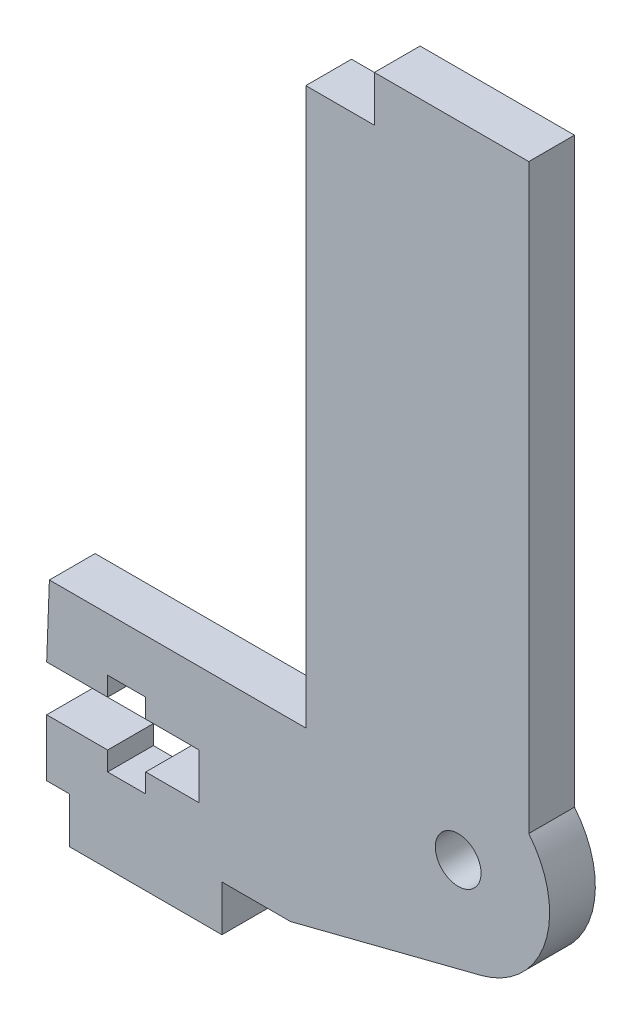
ISO-10303-21;
HEADER;
FILE_DESCRIPTION(('STEP AP214'),'2;1');
FILE_NAME('part.step','',(''),(''),'','','');
FILE_SCHEMA(('AUTOMOTIVE_DESIGN { 1 0 10303 214 1 1 1 1 }'));
ENDSEC;
DATA;
#1=APPLICATION_CONTEXT('core data for automotive mechanical design processes');
#2=APPLICATION_PROTOCOL_DEFINITION('international standard','automotive_design',2000,#1);
#3=PRODUCT_CONTEXT('',#1,'mechanical');
#4=PRODUCT('Part','Part','',(#3));
#5=PRODUCT_RELATED_PRODUCT_CATEGORY('part','',(#4));
#6=PRODUCT_DEFINITION_FORMATION('','',#4);
#7=PRODUCT_DEFINITION_CONTEXT('part definition',#1,'design');
#8=PRODUCT_DEFINITION('design','',#6,#7);
#9=PRODUCT_DEFINITION_SHAPE('','',#8);
#10=(LENGTH_UNIT() NAMED_UNIT(*) SI_UNIT(.MILLI.,.METRE.));
#11=(NAMED_UNIT(*) PLANE_ANGLE_UNIT() SI_UNIT($,.RADIAN.));
#12=(NAMED_UNIT(*) SI_UNIT($,.STERADIAN.) SOLID_ANGLE_UNIT());
#13=UNCERTAINTY_MEASURE_WITH_UNIT(LENGTH_MEASURE(1.E-05),#10,'distance_accuracy_value','');
#14=(GEOMETRIC_REPRESENTATION_CONTEXT(3) GLOBAL_UNCERTAINTY_ASSIGNED_CONTEXT((#13)) GLOBAL_UNIT_ASSIGNED_CONTEXT((#10,
#11,#12)) REPRESENTATION_CONTEXT('',''));
#15=CARTESIAN_POINT('',(0.,0.,0.));
#16=DIRECTION('',(0.,0.,1.));
#17=DIRECTION('',(1.,0.,0.));
#18=AXIS2_PLACEMENT_3D('',#15,#16,#17);
#19=CARTESIAN_POINT('',(94.7457309773274,26.4872774063565,3.));
#20=DIRECTION('',(0.,0.,1.));
#21=DIRECTION('',(1.,0.,0.));
#22=AXIS2_PLACEMENT_3D('',#19,#20,#21);
#23=PLANE('',#22);
#24=CARTESIAN_POINT('',(94.7457309773274,26.4872774063565,3.));
#25=DIRECTION('',(0.,0.,1.));
#26=DIRECTION('',(1.,0.,0.));
#27=AXIS2_PLACEMENT_3D('',#24,#25,#26);
#28=CIRCLE('',#27,5.99999123161333);
#29=CARTESIAN_POINT('',(96.2295870827808,20.6736670102476,3.));
#30=VERTEX_POINT('',#29);
#31=CARTESIAN_POINT('',(99.3761172670782,30.3029578944379,3.));
#32=VERTEX_POINT('',#31);
#33=EDGE_CURVE('E290',#30,#32,#28,.T.);
#34=ORIENTED_EDGE('',*,*,#33,.T.);
#35=DIRECTION('',(0.,1.,0.));
#36=VECTOR('',#35,1.);
#37=CARTESIAN_POINT('',(99.3761172670782,65.4874881536323,3.));
#38=LINE('',#37,#36);
#39=CARTESIAN_POINT('',(99.3761172670782,68.4872670102476,3.));
#40=VERTEX_POINT('',#39);
#41=EDGE_CURVE('E147',#32,#40,#38,.T.);
#42=ORIENTED_EDGE('',*,*,#41,.T.);
#43=DIRECTION('',(-1.,0.,0.));
#44=VECTOR('',#43,1.);
#45=CARTESIAN_POINT('',(89.2456174755169,68.4872670102476,3.));
#46=LINE('',#45,#44);
#47=CARTESIAN_POINT('',(89.2456174755169,68.4872670102476,3.));
#48=VERTEX_POINT('',#47);
#49=EDGE_CURVE('E359',#40,#48,#46,.T.);
#50=ORIENTED_EDGE('',*,*,#49,.T.);
#51=DIRECTION('',(0.,-1.,0.));
#52=VECTOR('',#51,1.);
#53=CARTESIAN_POINT('',(89.2456174755169,65.4872670102476,3.));
#54=LINE('',#53,#52);
#55=CARTESIAN_POINT('',(89.2456174755169,65.4872670102476,3.));
#56=VERTEX_POINT('',#55);
#57=EDGE_CURVE('E378',#48,#56,#54,.T.);
#58=ORIENTED_EDGE('',*,*,#57,.T.);
#59=DIRECTION('',(-1.,0.,0.));
#60=VECTOR('',#59,1.);
#61=CARTESIAN_POINT('',(89.2456174755169,65.4872670102476,3.));
#62=LINE('',#61,#60);
#63=CARTESIAN_POINT('',(84.7456174755169,65.4872670102476,3.));
#64=VERTEX_POINT('',#63);
#65=EDGE_CURVE('E375',#56,#64,#62,.T.);
#66=ORIENTED_EDGE('',*,*,#65,.T.);
#67=DIRECTION('',(0.,-1.,0.));
#68=VECTOR('',#67,1.);
#69=CARTESIAN_POINT('',(84.7456174755169,65.4872670102476,3.));
#70=LINE('',#69,#68);
#71=CARTESIAN_POINT('',(84.7456174755169,28.9872670102526,3.));
#72=VERTEX_POINT('',#71);
#73=EDGE_CURVE('E377',#64,#72,#70,.T.);
#74=ORIENTED_EDGE('',*,*,#73,.T.);
#75=DIRECTION('',(-1.,0.,0.));
#76=VECTOR('',#75,1.);
#77=CARTESIAN_POINT('',(68.9956870827807,28.9872670102526,3.));
#78=LINE('',#77,#76);
#79=CARTESIAN_POINT('',(67.9243112045356,28.9872670102526,3.));
#80=VERTEX_POINT('',#79);
#81=EDGE_CURVE('E380',#72,#80,#78,.T.);
#82=ORIENTED_EDGE('',*,*,#81,.T.);
#83=DIRECTION('',(-0.037578516973306,-0.99929367808572,0.));
#84=VECTOR('',#83,1.);
#85=CARTESIAN_POINT('',(67.9243112045356,28.9872670102526,3.));
#86=LINE('',#85,#84);
#87=CARTESIAN_POINT('',(67.7456870827807,24.2372670102526,3.));
#88=VERTEX_POINT('',#87);
#89=EDGE_CURVE('E386',#80,#88,#86,.T.);
#90=ORIENTED_EDGE('',*,*,#89,.T.);
#91=DIRECTION('',(1.,0.,0.));
#92=VECTOR('',#91,1.);
#93=CARTESIAN_POINT('',(67.7456870827807,24.2372670102526,3.));
#94=LINE('',#93,#92);
#95=CARTESIAN_POINT('',(71.7456870827807,24.2372670102526,3.));
#96=VERTEX_POINT('',#95);
#97=EDGE_CURVE('E388',#88,#96,#94,.T.);
#98=ORIENTED_EDGE('',*,*,#97,.T.);
#99=DIRECTION('',(0.,1.,0.));
#100=VECTOR('',#99,1.);
#101=CARTESIAN_POINT('',(71.7456870827807,24.2372670102526,3.));
#102=LINE('',#101,#100);
#103=CARTESIAN_POINT('',(71.7456870827807,25.4872670102526,3.));
#104=VERTEX_POINT('',#103);
#105=EDGE_CURVE('E390',#96,#104,#102,.T.);
#106=ORIENTED_EDGE('',*,*,#105,.T.);
#107=DIRECTION('',(1.,0.,0.));
#108=VECTOR('',#107,1.);
#109=CARTESIAN_POINT('',(71.7456870827807,25.4872670102526,3.));
#110=LINE('',#109,#108);
#111=CARTESIAN_POINT('',(74.2456870827807,25.4872670102526,3.));
#112=VERTEX_POINT('',#111);
#113=EDGE_CURVE('E392',#104,#112,#110,.T.);
#114=ORIENTED_EDGE('',*,*,#113,.T.);
#115=DIRECTION('',(0.,-1.,0.));
#116=VECTOR('',#115,1.);
#117=CARTESIAN_POINT('',(74.2456870827807,25.4872670102526,3.));
#118=LINE('',#117,#116);
#119=CARTESIAN_POINT('',(74.2456870827807,24.2372670102526,3.));
#120=VERTEX_POINT('',#119);
#121=EDGE_CURVE('E394',#112,#120,#118,.T.);
#122=ORIENTED_EDGE('',*,*,#121,.T.);
#123=DIRECTION('',(1.,0.,0.));
#124=VECTOR('',#123,1.);
#125=CARTESIAN_POINT('',(74.2456870827807,24.2372670102526,3.));
#126=LINE('',#125,#124);
#127=CARTESIAN_POINT('',(77.7456870827807,24.2372670102526,3.));
#128=VERTEX_POINT('',#127);
#129=EDGE_CURVE('E396',#120,#128,#126,.T.);
#130=ORIENTED_EDGE('',*,*,#129,.T.);
#131=DIRECTION('',(0.,-1.,0.));
#132=VECTOR('',#131,1.);
#133=CARTESIAN_POINT('',(77.7456870827807,21.2372670102526,3.));
#134=LINE('',#133,#132);
#135=CARTESIAN_POINT('',(77.7456870827807,21.2372670102526,3.));
#136=VERTEX_POINT('',#135);
#137=EDGE_CURVE('E398',#128,#136,#134,.T.);
#138=ORIENTED_EDGE('',*,*,#137,.T.);
#139=DIRECTION('',(-1.,0.,0.));
#140=VECTOR('',#139,1.);
#141=CARTESIAN_POINT('',(74.2456870827808,21.2372670102526,3.));
#142=LINE('',#141,#140);
#143=CARTESIAN_POINT('',(74.2456870827808,21.2372670102526,3.));
#144=VERTEX_POINT('',#143);
#145=EDGE_CURVE('E400',#136,#144,#142,.T.);
#146=ORIENTED_EDGE('',*,*,#145,.T.);
#147=DIRECTION('',(0.,-1.,0.));
#148=VECTOR('',#147,1.);
#149=CARTESIAN_POINT('',(74.2456870827808,21.2372670102526,3.));
#150=LINE('',#149,#148);
#151=CARTESIAN_POINT('',(74.2456870827808,19.9872670102526,3.));
#152=VERTEX_POINT('',#151);
#153=EDGE_CURVE('E402',#144,#152,#150,.T.);
#154=ORIENTED_EDGE('',*,*,#153,.T.);
#155=DIRECTION('',(-1.,0.,0.));
#156=VECTOR('',#155,1.);
#157=CARTESIAN_POINT('',(71.7456870827807,19.9872670102526,3.));
#158=LINE('',#157,#156);
#159=CARTESIAN_POINT('',(71.7456870827807,19.9872670102526,3.));
#160=VERTEX_POINT('',#159);
#161=EDGE_CURVE('E404',#152,#160,#158,.T.);
#162=ORIENTED_EDGE('',*,*,#161,.T.);
#163=DIRECTION('',(0.,1.,0.));
#164=VECTOR('',#163,1.);
#165=CARTESIAN_POINT('',(71.7456870827807,19.9872670102526,3.));
#166=LINE('',#165,#164);
#167=CARTESIAN_POINT('',(71.7456870827807,21.2372670102526,3.));
#168=VERTEX_POINT('',#167);
#169=EDGE_CURVE('E406',#160,#168,#166,.T.);
#170=ORIENTED_EDGE('',*,*,#169,.T.);
#171=DIRECTION('',(-1.,0.,0.));
#172=VECTOR('',#171,1.);
#173=CARTESIAN_POINT('',(71.7456870827807,21.2372670102526,3.));
#174=LINE('',#173,#172);
#175=CARTESIAN_POINT('',(67.7456870827807,21.2372670102526,3.));
#176=VERTEX_POINT('',#175);
#177=EDGE_CURVE('E408',#168,#176,#174,.T.);
#178=ORIENTED_EDGE('',*,*,#177,.T.);
#179=DIRECTION('',(0.,-1.,0.));
#180=VECTOR('',#179,1.);
#181=CARTESIAN_POINT('',(67.7456870827807,17.4872670102526,3.));
#182=LINE('',#181,#180);
#183=CARTESIAN_POINT('',(67.7456870827807,17.4872670102526,3.));
#184=VERTEX_POINT('',#183);
#185=EDGE_CURVE('E410',#176,#184,#182,.T.);
#186=ORIENTED_EDGE('',*,*,#185,.T.);
#187=DIRECTION('',(1.,0.,0.));
#188=VECTOR('',#187,1.);
#189=CARTESIAN_POINT('',(67.7456870827807,17.4872670102526,3.));
#190=LINE('',#189,#188);
#191=CARTESIAN_POINT('',(69.2456870827807,17.4872670102526,3.));
#192=VERTEX_POINT('',#191);
#193=EDGE_CURVE('E412',#184,#192,#190,.T.);
#194=ORIENTED_EDGE('',*,*,#193,.T.);
#195=DIRECTION('',(1.01754404439195E-06,-0.999999999999482,0.));
#196=VECTOR('',#195,1.);
#197=CARTESIAN_POINT('',(69.2456870827807,17.4872670102526,3.));
#198=LINE('',#197,#196);
#199=CARTESIAN_POINT('',(69.2456901354128,14.4872670102476,3.));
#200=VERTEX_POINT('',#199);
#201=EDGE_CURVE('E414',#192,#200,#198,.T.);
#202=ORIENTED_EDGE('',*,*,#201,.T.);
#203=DIRECTION('',(1.,0.,0.));
#204=VECTOR('',#203,1.);
#205=CARTESIAN_POINT('',(69.2456901354128,14.4872670102476,3.));
#206=LINE('',#205,#204);
#207=CARTESIAN_POINT('',(79.2456870827808,14.4872670102476,3.));
#208=VERTEX_POINT('',#207);
#209=EDGE_CURVE('E220',#200,#208,#206,.T.);
#210=ORIENTED_EDGE('',*,*,#209,.T.);
#211=DIRECTION('',(0.,1.,0.));
#212=VECTOR('',#211,1.);
#213=CARTESIAN_POINT('',(79.2456870827808,14.4872670102476,3.));
#214=LINE('',#213,#212);
#215=CARTESIAN_POINT('',(79.2456870827808,17.4872670102476,3.));
#216=VERTEX_POINT('',#215);
#217=EDGE_CURVE('E214',#208,#216,#214,.T.);
#218=ORIENTED_EDGE('',*,*,#217,.T.);
#219=DIRECTION('',(1.,0.,0.));
#220=VECTOR('',#219,1.);
#221=CARTESIAN_POINT('',(79.2456870827808,17.4872670102476,3.));
#222=LINE('',#221,#220);
#223=CARTESIAN_POINT('',(83.7456870827809,17.4872670102477,3.));
#224=VERTEX_POINT('',#223);
#225=EDGE_CURVE('E218',#216,#224,#222,.T.);
#226=ORIENTED_EDGE('',*,*,#225,.T.);
#227=DIRECTION('',(0.968935915986547,0.247311929981777,0.));
#228=VECTOR('',#227,1.);
#229=CARTESIAN_POINT('',(83.7456870827809,17.4872670102477,3.));
#230=LINE('',#229,#228);
#231=EDGE_CURVE('E50',#224,#30,#230,.T.);
#232=ORIENTED_EDGE('',*,*,#231,.T.);
#233=EDGE_LOOP('',(#34,#42,#50,#58,#66,#74,#82,#90,#98,#106,#114,#122,#130,#138,#146,#154,#162,
#170,#178,#186,#194,#202,#210,#218,#226,#232));
#234=FACE_BOUND('',#233,.T.);
#235=CARTESIAN_POINT('',(94.7456870811145,26.4872670119198,3.));
#236=DIRECTION('',(0.,0.,1.));
#237=DIRECTION('',(1.,0.,0.));
#238=AXIS2_PLACEMENT_3D('',#235,#236,#237);
#239=CIRCLE('',#238,1.50000000166626);
#240=CARTESIAN_POINT('',(96.2456870827808,26.4872670119198,3.));
#241=VERTEX_POINT('',#240);
#242=EDGE_CURVE('E242',#241,#241,#239,.T.);
#243=ORIENTED_EDGE('',*,*,#242,.F.);
#244=EDGE_LOOP('',(#243));
#245=FACE_BOUND('',#244,.T.);
#246=ADVANCED_FACE('F33',(#234,#245),#23,.T.);
#247=CARTESIAN_POINT('',(94.7457309773274,26.4872774063565,0.));
#248=DIRECTION('',(0.,0.,1.));
#249=DIRECTION('',(1.,0.,0.));
#250=AXIS2_PLACEMENT_3D('',#247,#248,#249);
#251=PLANE('',#250);
#252=CARTESIAN_POINT('',(94.7457309773274,26.4872774063565,0.));
#253=DIRECTION('',(0.,0.,1.));
#254=DIRECTION('',(1.,0.,0.));
#255=AXIS2_PLACEMENT_3D('',#252,#253,#254);
#256=CIRCLE('',#255,5.99999123161333);
#257=CARTESIAN_POINT('',(96.2295870827808,20.6736670102476,0.));
#258=VERTEX_POINT('',#257);
#259=CARTESIAN_POINT('',(99.3761172670782,30.3029578944379,0.));
#260=VERTEX_POINT('',#259);
#261=EDGE_CURVE('E238',#258,#260,#256,.T.);
#262=ORIENTED_EDGE('',*,*,#261,.F.);
#263=DIRECTION('',(0.968935915986547,0.247311929981777,0.));
#264=VECTOR('',#263,1.);
#265=CARTESIAN_POINT('',(83.7456870827809,17.4872670102477,0.));
#266=LINE('',#265,#264);
#267=CARTESIAN_POINT('',(83.7456870827809,17.4872670102477,0.));
#268=VERTEX_POINT('',#267);
#269=EDGE_CURVE('E139',#268,#258,#266,.T.);
#270=ORIENTED_EDGE('',*,*,#269,.F.);
#271=DIRECTION('',(1.,0.,0.));
#272=VECTOR('',#271,1.);
#273=CARTESIAN_POINT('',(79.2456870827808,17.4872670102476,0.));
#274=LINE('',#273,#272);
#275=CARTESIAN_POINT('',(79.2456870827808,17.4872670102476,0.));
#276=VERTEX_POINT('',#275);
#277=EDGE_CURVE('E133',#276,#268,#274,.T.);
#278=ORIENTED_EDGE('',*,*,#277,.F.);
#279=DIRECTION('',(0.,1.,0.));
#280=VECTOR('',#279,1.);
#281=CARTESIAN_POINT('',(79.2456870827808,14.4872670102476,0.));
#282=LINE('',#281,#280);
#283=CARTESIAN_POINT('',(79.2456870827808,14.4872670102476,0.));
#284=VERTEX_POINT('',#283);
#285=EDGE_CURVE('E228',#284,#276,#282,.T.);
#286=ORIENTED_EDGE('',*,*,#285,.F.);
#287=DIRECTION('',(1.,0.,0.));
#288=VECTOR('',#287,1.);
#289=CARTESIAN_POINT('',(69.2456901354128,14.4872670102476,0.));
#290=LINE('',#289,#288);
#291=CARTESIAN_POINT('',(69.2456901354128,14.4872670102476,0.));
#292=VERTEX_POINT('',#291);
#293=EDGE_CURVE('E285',#292,#284,#290,.T.);
#294=ORIENTED_EDGE('',*,*,#293,.F.);
#295=DIRECTION('',(1.01754404439195E-06,-0.999999999999482,0.));
#296=VECTOR('',#295,1.);
#297=CARTESIAN_POINT('',(69.2456870827807,17.4872670102526,0.));
#298=LINE('',#297,#296);
#299=CARTESIAN_POINT('',(69.2456870827807,17.4872670102526,0.));
#300=VERTEX_POINT('',#299);
#301=EDGE_CURVE('E283',#300,#292,#298,.T.);
#302=ORIENTED_EDGE('',*,*,#301,.F.);
#303=DIRECTION('',(1.,0.,0.));
#304=VECTOR('',#303,1.);
#305=CARTESIAN_POINT('',(67.7456870827807,17.4872670102526,0.));
#306=LINE('',#305,#304);
#307=CARTESIAN_POINT('',(67.7456870827807,17.4872670102526,0.));
#308=VERTEX_POINT('',#307);
#309=EDGE_CURVE('E281',#308,#300,#306,.T.);
#310=ORIENTED_EDGE('',*,*,#309,.F.);
#311=DIRECTION('',(0.,-1.,0.));
#312=VECTOR('',#311,1.);
#313=CARTESIAN_POINT('',(67.7456870827807,17.4872670102526,0.));
#314=LINE('',#313,#312);
#315=CARTESIAN_POINT('',(67.7456870827807,21.2372670102526,0.));
#316=VERTEX_POINT('',#315);
#317=EDGE_CURVE('E279',#316,#308,#314,.T.);
#318=ORIENTED_EDGE('',*,*,#317,.F.);
#319=DIRECTION('',(-1.,0.,0.));
#320=VECTOR('',#319,1.);
#321=CARTESIAN_POINT('',(71.7456870827807,21.2372670102526,0.));
#322=LINE('',#321,#320);
#323=CARTESIAN_POINT('',(71.7456870827807,21.2372670102526,0.));
#324=VERTEX_POINT('',#323);
#325=EDGE_CURVE('E277',#324,#316,#322,.T.);
#326=ORIENTED_EDGE('',*,*,#325,.F.);
#327=DIRECTION('',(0.,1.,0.));
#328=VECTOR('',#327,1.);
#329=CARTESIAN_POINT('',(71.7456870827807,19.9872670102526,0.));
#330=LINE('',#329,#328);
#331=CARTESIAN_POINT('',(71.7456870827807,19.9872670102526,0.));
#332=VERTEX_POINT('',#331);
#333=EDGE_CURVE('E275',#332,#324,#330,.T.);
#334=ORIENTED_EDGE('',*,*,#333,.F.);
#335=DIRECTION('',(-1.,0.,0.));
#336=VECTOR('',#335,1.);
#337=CARTESIAN_POINT('',(71.7456870827807,19.9872670102526,0.));
#338=LINE('',#337,#336);
#339=CARTESIAN_POINT('',(74.2456870827808,19.9872670102526,0.));
#340=VERTEX_POINT('',#339);
#341=EDGE_CURVE('E273',#340,#332,#338,.T.);
#342=ORIENTED_EDGE('',*,*,#341,.F.);
#343=DIRECTION('',(0.,-1.,0.));
#344=VECTOR('',#343,1.);
#345=CARTESIAN_POINT('',(74.2456870827808,21.2372670102526,0.));
#346=LINE('',#345,#344);
#347=CARTESIAN_POINT('',(74.2456870827808,21.2372670102526,0.));
#348=VERTEX_POINT('',#347);
#349=EDGE_CURVE('E271',#348,#340,#346,.T.);
#350=ORIENTED_EDGE('',*,*,#349,.F.);
#351=DIRECTION('',(-1.,0.,0.));
#352=VECTOR('',#351,1.);
#353=CARTESIAN_POINT('',(74.2456870827808,21.2372670102526,0.));
#354=LINE('',#353,#352);
#355=CARTESIAN_POINT('',(77.7456870827807,21.2372670102526,0.));
#356=VERTEX_POINT('',#355);
#357=EDGE_CURVE('E269',#356,#348,#354,.T.);
#358=ORIENTED_EDGE('',*,*,#357,.F.);
#359=DIRECTION('',(0.,-1.,0.));
#360=VECTOR('',#359,1.);
#361=CARTESIAN_POINT('',(77.7456870827807,21.2372670102526,0.));
#362=LINE('',#361,#360);
#363=CARTESIAN_POINT('',(77.7456870827807,24.2372670102526,0.));
#364=VERTEX_POINT('',#363);
#365=EDGE_CURVE('E267',#364,#356,#362,.T.);
#366=ORIENTED_EDGE('',*,*,#365,.F.);
#367=DIRECTION('',(1.,0.,0.));
#368=VECTOR('',#367,1.);
#369=CARTESIAN_POINT('',(74.2456870827807,24.2372670102526,0.));
#370=LINE('',#369,#368);
#371=CARTESIAN_POINT('',(74.2456870827807,24.2372670102526,0.));
#372=VERTEX_POINT('',#371);
#373=EDGE_CURVE('E265',#372,#364,#370,.T.);
#374=ORIENTED_EDGE('',*,*,#373,.F.);
#375=DIRECTION('',(0.,-1.,0.));
#376=VECTOR('',#375,1.);
#377=CARTESIAN_POINT('',(74.2456870827807,25.4872670102526,0.));
#378=LINE('',#377,#376);
#379=CARTESIAN_POINT('',(74.2456870827807,25.4872670102526,0.));
#380=VERTEX_POINT('',#379);
#381=EDGE_CURVE('E263',#380,#372,#378,.T.);
#382=ORIENTED_EDGE('',*,*,#381,.F.);
#383=DIRECTION('',(1.,0.,0.));
#384=VECTOR('',#383,1.);
#385=CARTESIAN_POINT('',(71.7456870827807,25.4872670102526,0.));
#386=LINE('',#385,#384);
#387=CARTESIAN_POINT('',(71.7456870827807,25.4872670102526,0.));
#388=VERTEX_POINT('',#387);
#389=EDGE_CURVE('E261',#388,#380,#386,.T.);
#390=ORIENTED_EDGE('',*,*,#389,.F.);
#391=DIRECTION('',(0.,1.,0.));
#392=VECTOR('',#391,1.);
#393=CARTESIAN_POINT('',(71.7456870827807,24.2372670102526,0.));
#394=LINE('',#393,#392);
#395=CARTESIAN_POINT('',(71.7456870827807,24.2372670102526,0.));
#396=VERTEX_POINT('',#395);
#397=EDGE_CURVE('E259',#396,#388,#394,.T.);
#398=ORIENTED_EDGE('',*,*,#397,.F.);
#399=DIRECTION('',(1.,0.,0.));
#400=VECTOR('',#399,1.);
#401=CARTESIAN_POINT('',(67.7456870827807,24.2372670102526,0.));
#402=LINE('',#401,#400);
#403=CARTESIAN_POINT('',(67.7456870827807,24.2372670102526,0.));
#404=VERTEX_POINT('',#403);
#405=EDGE_CURVE('E257',#404,#396,#402,.T.);
#406=ORIENTED_EDGE('',*,*,#405,.F.);
#407=DIRECTION('',(-0.037578516973306,-0.99929367808572,0.));
#408=VECTOR('',#407,1.);
#409=CARTESIAN_POINT('',(67.9243112045356,28.9872670102526,0.));
#410=LINE('',#409,#408);
#411=CARTESIAN_POINT('',(67.9243112045356,28.9872670102526,0.));
#412=VERTEX_POINT('',#411);
#413=EDGE_CURVE('E255',#412,#404,#410,.T.);
#414=ORIENTED_EDGE('',*,*,#413,.F.);
#415=DIRECTION('',(-1.,0.,0.));
#416=VECTOR('',#415,1.);
#417=CARTESIAN_POINT('',(68.9956870827807,28.9872670102526,0.));
#418=LINE('',#417,#416);
#419=CARTESIAN_POINT('',(84.7456174755169,28.9872670102526,0.));
#420=VERTEX_POINT('',#419);
#421=EDGE_CURVE('E253',#420,#412,#418,.T.);
#422=ORIENTED_EDGE('',*,*,#421,.F.);
#423=DIRECTION('',(0.,-1.,0.));
#424=VECTOR('',#423,1.);
#425=CARTESIAN_POINT('',(84.7456174755169,65.4872670102476,0.));
#426=LINE('',#425,#424);
#427=CARTESIAN_POINT('',(84.7456174755169,65.4872670102476,0.));
#428=VERTEX_POINT('',#427);
#429=EDGE_CURVE('E250',#428,#420,#426,.T.);
#430=ORIENTED_EDGE('',*,*,#429,.F.);
#431=DIRECTION('',(-1.,0.,0.));
#432=VECTOR('',#431,1.);
#433=CARTESIAN_POINT('',(89.2456174755169,65.4872670102476,0.));
#434=LINE('',#433,#432);
#435=CARTESIAN_POINT('',(89.2456174755169,65.4872670102476,0.));
#436=VERTEX_POINT('',#435);
#437=EDGE_CURVE('E248',#436,#428,#434,.T.);
#438=ORIENTED_EDGE('',*,*,#437,.F.);
#439=DIRECTION('',(0.,-1.,0.));
#440=VECTOR('',#439,1.);
#441=CARTESIAN_POINT('',(89.2456174755169,65.4872670102476,0.));
#442=LINE('',#441,#440);
#443=CARTESIAN_POINT('',(89.2456174755169,68.4872670102476,0.));
#444=VERTEX_POINT('',#443);
#445=EDGE_CURVE('E246',#444,#436,#442,.T.);
#446=ORIENTED_EDGE('',*,*,#445,.F.);
#447=DIRECTION('',(-1.,0.,0.));
#448=VECTOR('',#447,1.);
#449=CARTESIAN_POINT('',(89.2456174755169,68.4872670102476,0.));
#450=LINE('',#449,#448);
#451=CARTESIAN_POINT('',(99.3761172670782,68.4872670102476,0.));
#452=VERTEX_POINT('',#451);
#453=EDGE_CURVE('E244',#452,#444,#450,.T.);
#454=ORIENTED_EDGE('',*,*,#453,.F.);
#455=DIRECTION('',(0.,1.,0.));
#456=VECTOR('',#455,1.);
#457=CARTESIAN_POINT('',(99.3761172670782,68.4872670102476,0.));
#458=LINE('',#457,#456);
#459=EDGE_CURVE('E241',#260,#452,#458,.T.);
#460=ORIENTED_EDGE('',*,*,#459,.F.);
#461=EDGE_LOOP('',(#262,#270,#278,#286,#294,#302,#310,#318,#326,#334,#342,#350,#358,#366,#374,
#382,#390,#398,#406,#414,#422,#430,#438,#446,#454,#460));
#462=FACE_BOUND('',#461,.T.);
#463=CARTESIAN_POINT('',(94.7456870811145,26.4872670119198,0.));
#464=DIRECTION('',(0.,0.,1.));
#465=DIRECTION('',(1.,0.,0.));
#466=AXIS2_PLACEMENT_3D('',#463,#464,#465);
#467=CIRCLE('',#466,1.50000000166626);
#468=CARTESIAN_POINT('',(96.2456870827808,26.4872670119198,0.));
#469=VERTEX_POINT('',#468);
#470=EDGE_CURVE('E748',#469,#469,#467,.T.);
#471=ORIENTED_EDGE('',*,*,#470,.T.);
#472=EDGE_LOOP('',(#471));
#473=FACE_BOUND('',#472,.T.);
#474=ADVANCED_FACE('F363',(#462,#473),#251,.F.);
#475=CARTESIAN_POINT('',(94.7457309773274,26.4872774063565,3.));
#476=DIRECTION('',(0.,0.,-1.));
#477=DIRECTION('',(-1.,0.,0.));
#478=AXIS2_PLACEMENT_3D('',#475,#476,#477);
#479=CYLINDRICAL_SURFACE('',#478,5.99999123161333);
#480=ORIENTED_EDGE('',*,*,#261,.T.);
#481=DIRECTION('',(0.,0.,-1.));
#482=VECTOR('',#481,1.);
#483=CARTESIAN_POINT('',(99.3761172670782,30.3029578944379,3.));
#484=LINE('',#483,#482);
#485=EDGE_CURVE('E11',#32,#260,#484,.T.);
#486=ORIENTED_EDGE('',*,*,#485,.F.);
#487=ORIENTED_EDGE('',*,*,#33,.F.);
#488=DIRECTION('',(0.,0.,-1.));
#489=VECTOR('',#488,1.);
#490=CARTESIAN_POINT('',(96.2295870827808,20.6736670102476,3.));
#491=LINE('',#490,#489);
#492=EDGE_CURVE('E234',#30,#258,#491,.T.);
#493=ORIENTED_EDGE('',*,*,#492,.T.);
#494=EDGE_LOOP('',(#480,#486,#487,#493));
#495=FACE_BOUND('',#494,.T.);
#496=ADVANCED_FACE('F35',(#495),#479,.T.);
#497=CARTESIAN_POINT('',(99.3761172670782,68.4872670102476,3.));
#498=DIRECTION('',(-1.,0.,0.));
#499=DIRECTION('',(0.,0.,1.));
#500=AXIS2_PLACEMENT_3D('',#497,#498,#499);
#501=PLANE('',#500);
#502=ORIENTED_EDGE('',*,*,#459,.T.);
#503=DIRECTION('',(0.,0.,-1.));
#504=VECTOR('',#503,1.);
#505=CARTESIAN_POINT('',(99.3761172670782,68.4872670102476,3.));
#506=LINE('',#505,#504);
#507=EDGE_CURVE('E42',#40,#452,#506,.T.);
#508=ORIENTED_EDGE('',*,*,#507,.F.);
#509=ORIENTED_EDGE('',*,*,#41,.F.);
#510=ORIENTED_EDGE('',*,*,#485,.T.);
#511=EDGE_LOOP('',(#502,#508,#509,#510));
#512=FACE_BOUND('',#511,.T.);
#513=ADVANCED_FACE('F448',(#512),#501,.F.);
#514=CARTESIAN_POINT('',(89.2456174755169,68.4872670102476,3.));
#515=DIRECTION('',(0.,-1.,0.));
#516=DIRECTION('',(0.,0.,-1.));
#517=AXIS2_PLACEMENT_3D('',#514,#515,#516);
#518=PLANE('',#517);
#519=ORIENTED_EDGE('',*,*,#453,.T.);
#520=DIRECTION('',(0.,0.,-1.));
#521=VECTOR('',#520,1.);
#522=CARTESIAN_POINT('',(89.2456174755169,68.4872670102476,3.));
#523=LINE('',#522,#521);
#524=EDGE_CURVE('E351',#48,#444,#523,.T.);
#525=ORIENTED_EDGE('',*,*,#524,.F.);
#526=ORIENTED_EDGE('',*,*,#49,.F.);
#527=ORIENTED_EDGE('',*,*,#507,.T.);
#528=EDGE_LOOP('',(#519,#525,#526,#527));
#529=FACE_BOUND('',#528,.T.);
#530=ADVANCED_FACE('F357',(#529),#518,.F.);
#531=CARTESIAN_POINT('',(89.2456174755169,65.4872670102476,3.));
#532=DIRECTION('',(1.,0.,0.));
#533=DIRECTION('',(0.,0.,-1.));
#534=AXIS2_PLACEMENT_3D('',#531,#532,#533);
#535=PLANE('',#534);
#536=ORIENTED_EDGE('',*,*,#445,.T.);
#537=DIRECTION('',(0.,0.,-1.));
#538=VECTOR('',#537,1.);
#539=CARTESIAN_POINT('',(89.2456174755169,65.4872670102476,3.));
#540=LINE('',#539,#538);
#541=EDGE_CURVE('E348',#56,#436,#540,.T.);
#542=ORIENTED_EDGE('',*,*,#541,.F.);
#543=ORIENTED_EDGE('',*,*,#57,.F.);
#544=ORIENTED_EDGE('',*,*,#524,.T.);
#545=EDGE_LOOP('',(#536,#542,#543,#544));
#546=FACE_BOUND('',#545,.T.);
#547=ADVANCED_FACE('F369',(#546),#535,.F.);
#548=CARTESIAN_POINT('',(89.2456174755169,65.4872670102476,3.));
#549=DIRECTION('',(0.,-1.,0.));
#550=DIRECTION('',(0.,0.,-1.));
#551=AXIS2_PLACEMENT_3D('',#548,#549,#550);
#552=PLANE('',#551);
#553=ORIENTED_EDGE('',*,*,#437,.T.);
#554=DIRECTION('',(0.,0.,-1.));
#555=VECTOR('',#554,1.);
#556=CARTESIAN_POINT('',(84.7456174755169,65.4872670102476,3.));
#557=LINE('',#556,#555);
#558=EDGE_CURVE('E345',#64,#428,#557,.T.);
#559=ORIENTED_EDGE('',*,*,#558,.F.);
#560=ORIENTED_EDGE('',*,*,#65,.F.);
#561=ORIENTED_EDGE('',*,*,#541,.T.);
#562=EDGE_LOOP('',(#553,#559,#560,#561));
#563=FACE_BOUND('',#562,.T.);
#564=ADVANCED_FACE('F373',(#563),#552,.F.);
#565=CARTESIAN_POINT('',(84.7456174755169,65.4872670102476,3.));
#566=DIRECTION('',(1.,0.,0.));
#567=DIRECTION('',(0.,0.,-1.));
#568=AXIS2_PLACEMENT_3D('',#565,#566,#567);
#569=PLANE('',#568);
#570=ORIENTED_EDGE('',*,*,#429,.T.);
#571=DIRECTION('',(0.,0.,-1.));
#572=VECTOR('',#571,1.);
#573=CARTESIAN_POINT('',(84.7456174755169,28.9872670102526,3.));
#574=LINE('',#573,#572);
#575=EDGE_CURVE('E342',#72,#420,#574,.T.);
#576=ORIENTED_EDGE('',*,*,#575,.F.);
#577=ORIENTED_EDGE('',*,*,#73,.F.);
#578=ORIENTED_EDGE('',*,*,#558,.T.);
#579=EDGE_LOOP('',(#570,#576,#577,#578));
#580=FACE_BOUND('',#579,.T.);
#581=ADVANCED_FACE('F461',(#580),#569,.F.);
#582=CARTESIAN_POINT('',(68.9956870827807,28.9872670102526,3.));
#583=DIRECTION('',(0.,-1.,0.));
#584=DIRECTION('',(0.,0.,-1.));
#585=AXIS2_PLACEMENT_3D('',#582,#583,#584);
#586=PLANE('',#585);
#587=ORIENTED_EDGE('',*,*,#421,.T.);
#588=DIRECTION('',(0.,0.,-1.));
#589=VECTOR('',#588,1.);
#590=CARTESIAN_POINT('',(67.9243112045356,28.9872670102526,3.));
#591=LINE('',#590,#589);
#592=EDGE_CURVE('E339',#80,#412,#591,.T.);
#593=ORIENTED_EDGE('',*,*,#592,.F.);
#594=ORIENTED_EDGE('',*,*,#81,.F.);
#595=ORIENTED_EDGE('',*,*,#575,.T.);
#596=EDGE_LOOP('',(#587,#593,#594,#595));
#597=FACE_BOUND('',#596,.T.);
#598=ADVANCED_FACE('F464',(#597),#586,.F.);
#599=CARTESIAN_POINT('',(67.9243112045356,28.9872670102526,3.));
#600=DIRECTION('',(0.99929367808572,-0.0375785169733059,0.));
#601=DIRECTION('',(0.037578516973306,0.99929367808572,0.));
#602=AXIS2_PLACEMENT_3D('',#599,#600,#601);
#603=PLANE('',#602);
#604=ORIENTED_EDGE('',*,*,#413,.T.);
#605=DIRECTION('',(0.,0.,-1.));
#606=VECTOR('',#605,1.);
#607=CARTESIAN_POINT('',(67.7456870827807,24.2372670102526,3.));
#608=LINE('',#607,#606);
#609=EDGE_CURVE('E336',#88,#404,#608,.T.);
#610=ORIENTED_EDGE('',*,*,#609,.F.);
#611=ORIENTED_EDGE('',*,*,#89,.F.);
#612=ORIENTED_EDGE('',*,*,#592,.T.);
#613=EDGE_LOOP('',(#604,#610,#611,#612));
#614=FACE_BOUND('',#613,.T.);
#615=ADVANCED_FACE('F468',(#614),#603,.F.);
#616=CARTESIAN_POINT('',(67.7456870827807,24.2372670102526,3.));
#617=DIRECTION('',(0.,1.,0.));
#618=DIRECTION('',(-1.,0.,0.));
#619=AXIS2_PLACEMENT_3D('',#616,#617,#618);
#620=PLANE('',#619);
#621=ORIENTED_EDGE('',*,*,#405,.T.);
#622=DIRECTION('',(0.,0.,-1.));
#623=VECTOR('',#622,1.);
#624=CARTESIAN_POINT('',(71.7456870827807,24.2372670102526,3.));
#625=LINE('',#624,#623);
#626=EDGE_CURVE('E333',#96,#396,#625,.T.);
#627=ORIENTED_EDGE('',*,*,#626,.F.);
#628=ORIENTED_EDGE('',*,*,#97,.F.);
#629=ORIENTED_EDGE('',*,*,#609,.T.);
#630=EDGE_LOOP('',(#621,#627,#628,#629));
#631=FACE_BOUND('',#630,.T.);
#632=ADVANCED_FACE('F472',(#631),#620,.F.);
#633=CARTESIAN_POINT('',(71.7456870827807,24.2372670102526,3.));
#634=DIRECTION('',(-1.,0.,0.));
#635=DIRECTION('',(0.,0.,1.));
#636=AXIS2_PLACEMENT_3D('',#633,#634,#635);
#637=PLANE('',#636);
#638=ORIENTED_EDGE('',*,*,#397,.T.);
#639=DIRECTION('',(0.,0.,-1.));
#640=VECTOR('',#639,1.);
#641=CARTESIAN_POINT('',(71.7456870827807,25.4872670102526,3.));
#642=LINE('',#641,#640);
#643=EDGE_CURVE('E330',#104,#388,#642,.T.);
#644=ORIENTED_EDGE('',*,*,#643,.F.);
#645=ORIENTED_EDGE('',*,*,#105,.F.);
#646=ORIENTED_EDGE('',*,*,#626,.T.);
#647=EDGE_LOOP('',(#638,#644,#645,#646));
#648=FACE_BOUND('',#647,.T.);
#649=ADVANCED_FACE('F476',(#648),#637,.F.);
#650=CARTESIAN_POINT('',(71.7456870827807,25.4872670102526,3.));
#651=DIRECTION('',(0.,1.,0.));
#652=DIRECTION('',(-1.,0.,0.));
#653=AXIS2_PLACEMENT_3D('',#650,#651,#652);
#654=PLANE('',#653);
#655=ORIENTED_EDGE('',*,*,#389,.T.);
#656=DIRECTION('',(0.,0.,-1.));
#657=VECTOR('',#656,1.);
#658=CARTESIAN_POINT('',(74.2456870827807,25.4872670102526,3.));
#659=LINE('',#658,#657);
#660=EDGE_CURVE('E327',#112,#380,#659,.T.);
#661=ORIENTED_EDGE('',*,*,#660,.F.);
#662=ORIENTED_EDGE('',*,*,#113,.F.);
#663=ORIENTED_EDGE('',*,*,#643,.T.);
#664=EDGE_LOOP('',(#655,#661,#662,#663));
#665=FACE_BOUND('',#664,.T.);
#666=ADVANCED_FACE('F480',(#665),#654,.F.);
#667=CARTESIAN_POINT('',(74.2456870827807,25.4872670102526,3.));
#668=DIRECTION('',(1.,0.,0.));
#669=DIRECTION('',(0.,0.,-1.));
#670=AXIS2_PLACEMENT_3D('',#667,#668,#669);
#671=PLANE('',#670);
#672=ORIENTED_EDGE('',*,*,#381,.T.);
#673=DIRECTION('',(0.,0.,-1.));
#674=VECTOR('',#673,1.);
#675=CARTESIAN_POINT('',(74.2456870827807,24.2372670102526,3.));
#676=LINE('',#675,#674);
#677=EDGE_CURVE('E324',#120,#372,#676,.T.);
#678=ORIENTED_EDGE('',*,*,#677,.F.);
#679=ORIENTED_EDGE('',*,*,#121,.F.);
#680=ORIENTED_EDGE('',*,*,#660,.T.);
#681=EDGE_LOOP('',(#672,#678,#679,#680));
#682=FACE_BOUND('',#681,.T.);
#683=ADVANCED_FACE('F484',(#682),#671,.F.);
#684=CARTESIAN_POINT('',(74.2456870827807,24.2372670102526,3.));
#685=DIRECTION('',(0.,1.,0.));
#686=DIRECTION('',(-1.,0.,0.));
#687=AXIS2_PLACEMENT_3D('',#684,#685,#686);
#688=PLANE('',#687);
#689=ORIENTED_EDGE('',*,*,#373,.T.);
#690=DIRECTION('',(0.,0.,-1.));
#691=VECTOR('',#690,1.);
#692=CARTESIAN_POINT('',(77.7456870827807,24.2372670102526,3.));
#693=LINE('',#692,#691);
#694=EDGE_CURVE('E321',#128,#364,#693,.T.);
#695=ORIENTED_EDGE('',*,*,#694,.F.);
#696=ORIENTED_EDGE('',*,*,#129,.F.);
#697=ORIENTED_EDGE('',*,*,#677,.T.);
#698=EDGE_LOOP('',(#689,#695,#696,#697));
#699=FACE_BOUND('',#698,.T.);
#700=ADVANCED_FACE('F488',(#699),#688,.F.);
#701=CARTESIAN_POINT('',(77.7456870827807,21.2372670102526,3.));
#702=DIRECTION('',(1.,0.,0.));
#703=DIRECTION('',(0.,0.,-1.));
#704=AXIS2_PLACEMENT_3D('',#701,#702,#703);
#705=PLANE('',#704);
#706=ORIENTED_EDGE('',*,*,#365,.T.);
#707=DIRECTION('',(0.,0.,-1.));
#708=VECTOR('',#707,1.);
#709=CARTESIAN_POINT('',(77.7456870827807,21.2372670102526,3.));
#710=LINE('',#709,#708);
#711=EDGE_CURVE('E318',#136,#356,#710,.T.);
#712=ORIENTED_EDGE('',*,*,#711,.F.);
#713=ORIENTED_EDGE('',*,*,#137,.F.);
#714=ORIENTED_EDGE('',*,*,#694,.T.);
#715=EDGE_LOOP('',(#706,#712,#713,#714));
#716=FACE_BOUND('',#715,.T.);
#717=ADVANCED_FACE('F492',(#716),#705,.F.);
#718=CARTESIAN_POINT('',(74.2456870827808,21.2372670102526,3.));
#719=DIRECTION('',(0.,-1.,0.));
#720=DIRECTION('',(1.,0.,0.));
#721=AXIS2_PLACEMENT_3D('',#718,#719,#720);
#722=PLANE('',#721);
#723=ORIENTED_EDGE('',*,*,#357,.T.);
#724=DIRECTION('',(0.,0.,-1.));
#725=VECTOR('',#724,1.);
#726=CARTESIAN_POINT('',(74.2456870827808,21.2372670102526,3.));
#727=LINE('',#726,#725);
#728=EDGE_CURVE('E315',#144,#348,#727,.T.);
#729=ORIENTED_EDGE('',*,*,#728,.F.);
#730=ORIENTED_EDGE('',*,*,#145,.F.);
#731=ORIENTED_EDGE('',*,*,#711,.T.);
#732=EDGE_LOOP('',(#723,#729,#730,#731));
#733=FACE_BOUND('',#732,.T.);
#734=ADVANCED_FACE('F496',(#733),#722,.F.);
#735=CARTESIAN_POINT('',(74.2456870827808,21.2372670102526,3.));
#736=DIRECTION('',(1.,0.,0.));
#737=DIRECTION('',(0.,0.,-1.));
#738=AXIS2_PLACEMENT_3D('',#735,#736,#737);
#739=PLANE('',#738);
#740=ORIENTED_EDGE('',*,*,#349,.T.);
#741=DIRECTION('',(0.,0.,-1.));
#742=VECTOR('',#741,1.);
#743=CARTESIAN_POINT('',(74.2456870827808,19.9872670102526,3.));
#744=LINE('',#743,#742);
#745=EDGE_CURVE('E312',#152,#340,#744,.T.);
#746=ORIENTED_EDGE('',*,*,#745,.F.);
#747=ORIENTED_EDGE('',*,*,#153,.F.);
#748=ORIENTED_EDGE('',*,*,#728,.T.);
#749=EDGE_LOOP('',(#740,#746,#747,#748));
#750=FACE_BOUND('',#749,.T.);
#751=ADVANCED_FACE('F500',(#750),#739,.F.);
#752=CARTESIAN_POINT('',(71.7456870827807,19.9872670102526,3.));
#753=DIRECTION('',(0.,-1.,0.));
#754=DIRECTION('',(1.,0.,0.));
#755=AXIS2_PLACEMENT_3D('',#752,#753,#754);
#756=PLANE('',#755);
#757=ORIENTED_EDGE('',*,*,#341,.T.);
#758=DIRECTION('',(0.,0.,-1.));
#759=VECTOR('',#758,1.);
#760=CARTESIAN_POINT('',(71.7456870827807,19.9872670102526,3.));
#761=LINE('',#760,#759);
#762=EDGE_CURVE('E309',#160,#332,#761,.T.);
#763=ORIENTED_EDGE('',*,*,#762,.F.);
#764=ORIENTED_EDGE('',*,*,#161,.F.);
#765=ORIENTED_EDGE('',*,*,#745,.T.);
#766=EDGE_LOOP('',(#757,#763,#764,#765));
#767=FACE_BOUND('',#766,.T.);
#768=ADVANCED_FACE('F504',(#767),#756,.F.);
#769=CARTESIAN_POINT('',(71.7456870827807,19.9872670102526,3.));
#770=DIRECTION('',(-1.,0.,0.));
#771=DIRECTION('',(0.,0.,1.));
#772=AXIS2_PLACEMENT_3D('',#769,#770,#771);
#773=PLANE('',#772);
#774=ORIENTED_EDGE('',*,*,#333,.T.);
#775=DIRECTION('',(0.,0.,-1.));
#776=VECTOR('',#775,1.);
#777=CARTESIAN_POINT('',(71.7456870827807,21.2372670102526,3.));
#778=LINE('',#777,#776);
#779=EDGE_CURVE('E306',#168,#324,#778,.T.);
#780=ORIENTED_EDGE('',*,*,#779,.F.);
#781=ORIENTED_EDGE('',*,*,#169,.F.);
#782=ORIENTED_EDGE('',*,*,#762,.T.);
#783=EDGE_LOOP('',(#774,#780,#781,#782));
#784=FACE_BOUND('',#783,.T.);
#785=ADVANCED_FACE('F508',(#784),#773,.F.);
#786=CARTESIAN_POINT('',(71.7456870827807,21.2372670102526,3.));
#787=DIRECTION('',(0.,-1.,0.));
#788=DIRECTION('',(1.,0.,0.));
#789=AXIS2_PLACEMENT_3D('',#786,#787,#788);
#790=PLANE('',#789);
#791=ORIENTED_EDGE('',*,*,#325,.T.);
#792=DIRECTION('',(0.,0.,-1.));
#793=VECTOR('',#792,1.);
#794=CARTESIAN_POINT('',(67.7456870827807,21.2372670102526,3.));
#795=LINE('',#794,#793);
#796=EDGE_CURVE('E303',#176,#316,#795,.T.);
#797=ORIENTED_EDGE('',*,*,#796,.F.);
#798=ORIENTED_EDGE('',*,*,#177,.F.);
#799=ORIENTED_EDGE('',*,*,#779,.T.);
#800=EDGE_LOOP('',(#791,#797,#798,#799));
#801=FACE_BOUND('',#800,.T.);
#802=ADVANCED_FACE('F512',(#801),#790,.F.);
#803=CARTESIAN_POINT('',(67.7456870827807,17.4872670102526,3.));
#804=DIRECTION('',(1.,0.,0.));
#805=DIRECTION('',(0.,0.,-1.));
#806=AXIS2_PLACEMENT_3D('',#803,#804,#805);
#807=PLANE('',#806);
#808=ORIENTED_EDGE('',*,*,#317,.T.);
#809=DIRECTION('',(0.,0.,-1.));
#810=VECTOR('',#809,1.);
#811=CARTESIAN_POINT('',(67.7456870827807,17.4872670102526,3.));
#812=LINE('',#811,#810);
#813=EDGE_CURVE('E300',#184,#308,#812,.T.);
#814=ORIENTED_EDGE('',*,*,#813,.F.);
#815=ORIENTED_EDGE('',*,*,#185,.F.);
#816=ORIENTED_EDGE('',*,*,#796,.T.);
#817=EDGE_LOOP('',(#808,#814,#815,#816));
#818=FACE_BOUND('',#817,.T.);
#819=ADVANCED_FACE('F516',(#818),#807,.F.);
#820=CARTESIAN_POINT('',(67.7456870827807,17.4872670102526,3.));
#821=DIRECTION('',(0.,1.,0.));
#822=DIRECTION('',(-1.,0.,0.));
#823=AXIS2_PLACEMENT_3D('',#820,#821,#822);
#824=PLANE('',#823);
#825=ORIENTED_EDGE('',*,*,#309,.T.);
#826=DIRECTION('',(0.,0.,-1.));
#827=VECTOR('',#826,1.);
#828=CARTESIAN_POINT('',(69.2456870827807,17.4872670102526,3.));
#829=LINE('',#828,#827);
#830=EDGE_CURVE('E297',#192,#300,#829,.T.);
#831=ORIENTED_EDGE('',*,*,#830,.F.);
#832=ORIENTED_EDGE('',*,*,#193,.F.);
#833=ORIENTED_EDGE('',*,*,#813,.T.);
#834=EDGE_LOOP('',(#825,#831,#832,#833));
#835=FACE_BOUND('',#834,.T.);
#836=ADVANCED_FACE('F520',(#835),#824,.F.);
#837=CARTESIAN_POINT('',(69.2456870827807,17.4872670102526,3.));
#838=DIRECTION('',(0.999999999999482,1.01754404439195E-06,0.));
#839=DIRECTION('',(-1.01754404439195E-06,0.999999999999482,0.));
#840=AXIS2_PLACEMENT_3D('',#837,#838,#839);
#841=PLANE('',#840);
#842=ORIENTED_EDGE('',*,*,#301,.T.);
#843=DIRECTION('',(0.,0.,-1.));
#844=VECTOR('',#843,1.);
#845=CARTESIAN_POINT('',(69.2456901354128,14.4872670102476,3.));
#846=LINE('',#845,#844);
#847=EDGE_CURVE('E294',#200,#292,#846,.T.);
#848=ORIENTED_EDGE('',*,*,#847,.F.);
#849=ORIENTED_EDGE('',*,*,#201,.F.);
#850=ORIENTED_EDGE('',*,*,#830,.T.);
#851=EDGE_LOOP('',(#842,#848,#849,#850));
#852=FACE_BOUND('',#851,.T.);
#853=ADVANCED_FACE('F420',(#852),#841,.F.);
#854=CARTESIAN_POINT('',(69.2456901354128,14.4872670102476,3.));
#855=DIRECTION('',(0.,1.,0.));
#856=DIRECTION('',(-1.,0.,0.));
#857=AXIS2_PLACEMENT_3D('',#854,#855,#856);
#858=PLANE('',#857);
#859=ORIENTED_EDGE('',*,*,#293,.T.);
#860=DIRECTION('',(0.,0.,-1.));
#861=VECTOR('',#860,1.);
#862=CARTESIAN_POINT('',(79.2456870827808,14.4872670102476,3.));
#863=LINE('',#862,#861);
#864=EDGE_CURVE('E229',#208,#284,#863,.T.);
#865=ORIENTED_EDGE('',*,*,#864,.F.);
#866=ORIENTED_EDGE('',*,*,#209,.F.);
#867=ORIENTED_EDGE('',*,*,#847,.T.);
#868=EDGE_LOOP('',(#859,#865,#866,#867));
#869=FACE_BOUND('',#868,.T.);
#870=ADVANCED_FACE('F424',(#869),#858,.F.);
#871=CARTESIAN_POINT('',(79.2456870827808,14.4872670102476,3.));
#872=DIRECTION('',(-1.,0.,0.));
#873=DIRECTION('',(0.,0.,1.));
#874=AXIS2_PLACEMENT_3D('',#871,#872,#873);
#875=PLANE('',#874);
#876=ORIENTED_EDGE('',*,*,#285,.T.);
#877=DIRECTION('',(0.,0.,-1.));
#878=VECTOR('',#877,1.);
#879=CARTESIAN_POINT('',(79.2456870827808,17.4872670102476,3.));
#880=LINE('',#879,#878);
#881=EDGE_CURVE('E225',#216,#276,#880,.T.);
#882=ORIENTED_EDGE('',*,*,#881,.F.);
#883=ORIENTED_EDGE('',*,*,#217,.F.);
#884=ORIENTED_EDGE('',*,*,#864,.T.);
#885=EDGE_LOOP('',(#876,#882,#883,#884));
#886=FACE_BOUND('',#885,.T.);
#887=ADVANCED_FACE('F226',(#886),#875,.F.);
#888=CARTESIAN_POINT('',(79.2456870827808,17.4872670102476,3.));
#889=DIRECTION('',(0.,1.,0.));
#890=DIRECTION('',(-1.,0.,0.));
#891=AXIS2_PLACEMENT_3D('',#888,#889,#890);
#892=PLANE('',#891);
#893=ORIENTED_EDGE('',*,*,#277,.T.);
#894=DIRECTION('',(0.,0.,-1.));
#895=VECTOR('',#894,1.);
#896=CARTESIAN_POINT('',(83.7456870827809,17.4872670102477,3.));
#897=LINE('',#896,#895);
#898=EDGE_CURVE('E230',#224,#268,#897,.T.);
#899=ORIENTED_EDGE('',*,*,#898,.F.);
#900=ORIENTED_EDGE('',*,*,#225,.F.);
#901=ORIENTED_EDGE('',*,*,#881,.T.);
#902=EDGE_LOOP('',(#893,#899,#900,#901));
#903=FACE_BOUND('',#902,.T.);
#904=ADVANCED_FACE('F232',(#903),#892,.F.);
#905=CARTESIAN_POINT('',(83.7456870827809,17.4872670102477,3.));
#906=DIRECTION('',(-0.247311929981777,0.968935915986547,0.));
#907=DIRECTION('',(-0.968935915986547,-0.247311929981777,0.));
#908=AXIS2_PLACEMENT_3D('',#905,#906,#907);
#909=PLANE('',#908);
#910=ORIENTED_EDGE('',*,*,#269,.T.);
#911=ORIENTED_EDGE('',*,*,#492,.F.);
#912=ORIENTED_EDGE('',*,*,#231,.F.);
#913=ORIENTED_EDGE('',*,*,#898,.T.);
#914=EDGE_LOOP('',(#910,#911,#912,#913));
#915=FACE_BOUND('',#914,.T.);
#916=ADVANCED_FACE('F428',(#915),#909,.F.);
#917=CARTESIAN_POINT('',(94.7456870811145,26.4872670119198,3.));
#918=DIRECTION('',(0.,0.,-1.));
#919=DIRECTION('',(-1.,0.,0.));
#920=AXIS2_PLACEMENT_3D('',#917,#918,#919);
#921=CYLINDRICAL_SURFACE('',#920,1.50000000166626);
#922=ORIENTED_EDGE('',*,*,#242,.T.);
#923=EDGE_LOOP('',(#922));
#924=FACE_BOUND('',#923,.T.);
#925=ORIENTED_EDGE('',*,*,#470,.F.);
#926=EDGE_LOOP('',(#925));
#927=FACE_BOUND('',#926,.T.);
#928=ADVANCED_FACE('F430',(#924,#927),#921,.F.);
#929=CLOSED_SHELL('',(#246,#474,#496,#513,#530,#547,#564,#581,#598,#615,#632,#649,#666,#683,
#700,#717,#734,#751,#768,#785,#802,#819,#836,#853,#870,#887,#904,#916,#928));
#930=MANIFOLD_SOLID_BREP('B2',#929);
#931=ADVANCED_BREP_SHAPE_REPRESENTATION('',(#18,#930),#14);
#932=SHAPE_DEFINITION_REPRESENTATION(#9,#931);
ENDSEC;
END-ISO-10303-21;
